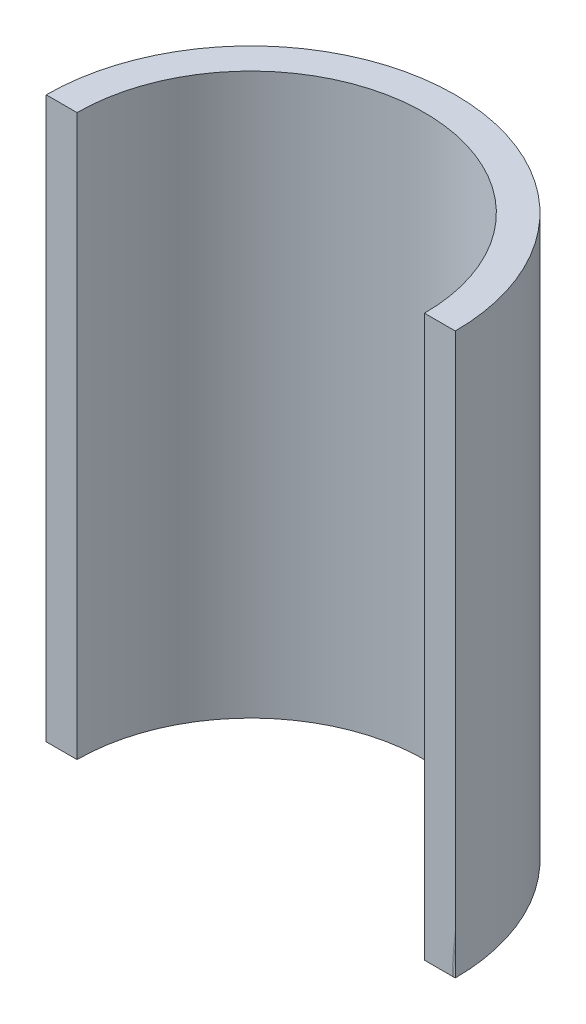
ISO-10303-21;
HEADER;
FILE_DESCRIPTION(('STEP AP214'),'2;1');
FILE_NAME('part.step','',(''),(''),'','','');
FILE_SCHEMA(('AUTOMOTIVE_DESIGN { 1 0 10303 214 1 1 1 1 }'));
ENDSEC;
DATA;
#1=APPLICATION_CONTEXT('core data for automotive mechanical design processes');
#2=APPLICATION_PROTOCOL_DEFINITION('international standard','automotive_design',2000,#1);
#3=PRODUCT_CONTEXT('',#1,'mechanical');
#4=PRODUCT('Part','Part','',(#3));
#5=PRODUCT_RELATED_PRODUCT_CATEGORY('part','',(#4));
#6=PRODUCT_DEFINITION_FORMATION('','',#4);
#7=PRODUCT_DEFINITION_CONTEXT('part definition',#1,'design');
#8=PRODUCT_DEFINITION('design','',#6,#7);
#9=PRODUCT_DEFINITION_SHAPE('','',#8);
#10=(LENGTH_UNIT() NAMED_UNIT(*) SI_UNIT(.MILLI.,.METRE.));
#11=(NAMED_UNIT(*) PLANE_ANGLE_UNIT() SI_UNIT($,.RADIAN.));
#12=(NAMED_UNIT(*) SI_UNIT($,.STERADIAN.) SOLID_ANGLE_UNIT());
#13=UNCERTAINTY_MEASURE_WITH_UNIT(LENGTH_MEASURE(1.E-05),#10,'distance_accuracy_value','');
#14=(GEOMETRIC_REPRESENTATION_CONTEXT(3) GLOBAL_UNCERTAINTY_ASSIGNED_CONTEXT((#13)) GLOBAL_UNIT_ASSIGNED_CONTEXT((#10,
#11,#12)) REPRESENTATION_CONTEXT('',''));
#15=CARTESIAN_POINT('',(0.,0.,0.));
#16=DIRECTION('',(0.,0.,1.));
#17=DIRECTION('',(1.,0.,0.));
#18=AXIS2_PLACEMENT_3D('',#15,#16,#17);
#19=CARTESIAN_POINT('',(36.5,100.,0.));
#20=DIRECTION('',(0.,0.,1.));
#21=DIRECTION('',(1.,0.,0.));
#22=AXIS2_PLACEMENT_3D('',#19,#20,#21);
#23=PLANE('',#22);
#24=DIRECTION('',(-1.,0.,0.));
#25=VECTOR('',#24,1.);
#26=CARTESIAN_POINT('',(36.5,0.,0.));
#27=LINE('',#26,#25);
#28=CARTESIAN_POINT('',(36.2,0.,0.));
#29=VERTEX_POINT('',#28);
#30=CARTESIAN_POINT('',(36.,0.,0.));
#31=VERTEX_POINT('',#30);
#32=EDGE_CURVE('E158',#29,#31,#27,.T.);
#33=ORIENTED_EDGE('',*,*,#32,.F.);
#34=CARTESIAN_POINT('',(86.,0.,0.));
#35=DIRECTION('',(0.,0.,1.));
#36=DIRECTION('',(1.,0.,0.));
#37=AXIS2_PLACEMENT_3D('',#34,#35,#36);
#38=CIRCLE('',#37,49.8);
#39=CARTESIAN_POINT('',(36.5,5.458021619598,0.));
#40=VERTEX_POINT('',#39);
#41=EDGE_CURVE('E11',#29,#40,#38,.F.);
#42=ORIENTED_EDGE('',*,*,#41,.T.);
#43=DIRECTION('',(0.,-1.,0.));
#44=VECTOR('',#43,1.);
#45=CARTESIAN_POINT('',(36.5,100.,0.));
#46=LINE('',#45,#44);
#47=CARTESIAN_POINT('',(36.5,7.05336798983309,0.));
#48=VERTEX_POINT('',#47);
#49=EDGE_CURVE('E110',#48,#40,#46,.T.);
#50=ORIENTED_EDGE('',*,*,#49,.F.);
#51=CARTESIAN_POINT('',(86.,0.,0.));
#52=DIRECTION('',(0.,0.,1.));
#53=DIRECTION('',(1.,0.,0.));
#54=AXIS2_PLACEMENT_3D('',#51,#52,#53);
#55=CIRCLE('',#54,50.);
#56=EDGE_CURVE('E56',#31,#48,#55,.F.);
#57=ORIENTED_EDGE('',*,*,#56,.F.);
#58=EDGE_LOOP('',(#33,#42,#50,#57));
#59=FACE_BOUND('',#58,.T.);
#60=ADVANCED_FACE('F47',(#59),#23,.T.);
#61=CARTESIAN_POINT('',(31.,0.,0.));
#62=VERTEX_POINT('',#61);
#63=EDGE_CURVE('E153',#31,#62,#27,.T.);
#64=ORIENTED_EDGE('',*,*,#63,.F.);
#65=ORIENTED_EDGE('',*,*,#56,.T.);
#66=CARTESIAN_POINT('',(36.5,100.,0.));
#67=VERTEX_POINT('',#66);
#68=EDGE_CURVE('E98',#67,#48,#46,.T.);
#69=ORIENTED_EDGE('',*,*,#68,.F.);
#70=DIRECTION('',(-1.,0.,0.));
#71=VECTOR('',#70,1.);
#72=CARTESIAN_POINT('',(36.5,100.,0.));
#73=LINE('',#72,#71);
#74=CARTESIAN_POINT('',(31.,100.,0.));
#75=VERTEX_POINT('',#74);
#76=EDGE_CURVE('E103',#67,#75,#73,.T.);
#77=ORIENTED_EDGE('',*,*,#76,.T.);
#78=DIRECTION('',(0.,-1.,0.));
#79=VECTOR('',#78,1.);
#80=CARTESIAN_POINT('',(31.,100.,0.));
#81=LINE('',#80,#79);
#82=EDGE_CURVE('E126',#62,#75,#81,.F.);
#83=ORIENTED_EDGE('',*,*,#82,.F.);
#84=EDGE_LOOP('',(#64,#65,#69,#77,#83));
#85=FACE_BOUND('',#84,.T.);
#86=ADVANCED_FACE('F101',(#85),#23,.T.);
#87=CARTESIAN_POINT('',(0.,100.,0.));
#88=DIRECTION('',(0.,-1.,0.));
#89=DIRECTION('',(0.,0.,-1.));
#90=AXIS2_PLACEMENT_3D('',#87,#88,#89);
#91=CYLINDRICAL_SURFACE('',#90,36.5);
#92=DIRECTION('',(0.,-1.,0.));
#93=VECTOR('',#92,1.);
#94=CARTESIAN_POINT('',(-36.5,100.,0.));
#95=LINE('',#94,#93);
#96=CARTESIAN_POINT('',(-36.5,100.,0.));
#97=VERTEX_POINT('',#96);
#98=CARTESIAN_POINT('',(-36.5,0.,0.));
#99=VERTEX_POINT('',#98);
#100=EDGE_CURVE('E121',#97,#99,#95,.T.);
#101=ORIENTED_EDGE('',*,*,#100,.F.);
#102=CARTESIAN_POINT('',(0.,100.,0.));
#103=DIRECTION('',(0.,1.,0.));
#104=DIRECTION('',(0.,0.,1.));
#105=AXIS2_PLACEMENT_3D('',#102,#103,#104);
#106=CIRCLE('',#105,36.5);
#107=EDGE_CURVE('E118',#67,#97,#106,.T.);
#108=ORIENTED_EDGE('',*,*,#107,.F.);
#109=ORIENTED_EDGE('',*,*,#68,.T.);
#110=ORIENTED_EDGE('',*,*,#49,.T.);
#111=CARTESIAN_POINT('',(36.5,0.,0.));
#112=VERTEX_POINT('',#111);
#113=EDGE_CURVE('E112',#40,#112,#46,.T.);
#114=ORIENTED_EDGE('',*,*,#113,.T.);
#115=CARTESIAN_POINT('',(0.,0.,0.));
#116=DIRECTION('',(0.,1.,0.));
#117=DIRECTION('',(0.,0.,1.));
#118=AXIS2_PLACEMENT_3D('',#115,#116,#117);
#119=CIRCLE('',#118,36.5);
#120=EDGE_CURVE('E127',#112,#99,#119,.T.);
#121=ORIENTED_EDGE('',*,*,#120,.T.);
#122=EDGE_LOOP('',(#101,#108,#109,#110,#114,#121));
#123=FACE_BOUND('',#122,.T.);
#124=ADVANCED_FACE('F49',(#123),#91,.T.);
#125=CARTESIAN_POINT('',(0.,100.,0.));
#126=DIRECTION('',(0.,1.,0.));
#127=DIRECTION('',(0.,0.,1.));
#128=AXIS2_PLACEMENT_3D('',#125,#126,#127);
#129=PLANE('',#128);
#130=ORIENTED_EDGE('',*,*,#107,.T.);
#131=CARTESIAN_POINT('',(-31.,100.,0.));
#132=VERTEX_POINT('',#131);
#133=EDGE_CURVE('E122',#132,#97,#73,.T.);
#134=ORIENTED_EDGE('',*,*,#133,.F.);
#135=CARTESIAN_POINT('',(0.,100.,0.));
#136=DIRECTION('',(0.,1.,0.));
#137=DIRECTION('',(0.,0.,1.));
#138=AXIS2_PLACEMENT_3D('',#135,#136,#137);
#139=CIRCLE('',#138,31.);
#140=EDGE_CURVE('E120',#75,#132,#139,.T.);
#141=ORIENTED_EDGE('',*,*,#140,.F.);
#142=ORIENTED_EDGE('',*,*,#76,.F.);
#143=EDGE_LOOP('',(#130,#134,#141,#142));
#144=FACE_BOUND('',#143,.T.);
#145=ADVANCED_FACE('F116',(#144),#129,.T.);
#146=CARTESIAN_POINT('',(0.,0.,0.));
#147=DIRECTION('',(0.,1.,0.));
#148=DIRECTION('',(0.,0.,1.));
#149=AXIS2_PLACEMENT_3D('',#146,#147,#148);
#150=PLANE('',#149);
#151=CARTESIAN_POINT('',(-31.,0.,0.));
#152=VERTEX_POINT('',#151);
#153=EDGE_CURVE('E152',#152,#99,#27,.T.);
#154=ORIENTED_EDGE('',*,*,#153,.T.);
#155=ORIENTED_EDGE('',*,*,#120,.F.);
#156=EDGE_CURVE('E156',#112,#29,#27,.T.);
#157=ORIENTED_EDGE('',*,*,#156,.T.);
#158=ORIENTED_EDGE('',*,*,#32,.T.);
#159=ORIENTED_EDGE('',*,*,#63,.T.);
#160=CARTESIAN_POINT('',(0.,0.,0.));
#161=DIRECTION('',(0.,1.,0.));
#162=DIRECTION('',(0.,0.,1.));
#163=AXIS2_PLACEMENT_3D('',#160,#161,#162);
#164=CIRCLE('',#163,31.);
#165=EDGE_CURVE('E109',#62,#152,#164,.T.);
#166=ORIENTED_EDGE('',*,*,#165,.T.);
#167=EDGE_LOOP('',(#154,#155,#157,#158,#159,#166));
#168=FACE_BOUND('',#167,.T.);
#169=ADVANCED_FACE('F150',(#168),#150,.F.);
#170=CARTESIAN_POINT('',(0.,100.,0.));
#171=DIRECTION('',(0.,-1.,0.));
#172=DIRECTION('',(0.,0.,-1.));
#173=AXIS2_PLACEMENT_3D('',#170,#171,#172);
#174=CYLINDRICAL_SURFACE('',#173,31.);
#175=ORIENTED_EDGE('',*,*,#140,.T.);
#176=DIRECTION('',(0.,-1.,0.));
#177=VECTOR('',#176,1.);
#178=CARTESIAN_POINT('',(-31.,100.,0.));
#179=LINE('',#178,#177);
#180=EDGE_CURVE('E129',#132,#152,#179,.T.);
#181=ORIENTED_EDGE('',*,*,#180,.T.);
#182=ORIENTED_EDGE('',*,*,#165,.F.);
#183=ORIENTED_EDGE('',*,*,#82,.T.);
#184=EDGE_LOOP('',(#175,#181,#182,#183));
#185=FACE_BOUND('',#184,.T.);
#186=ADVANCED_FACE('F146',(#185),#174,.F.);
#187=ORIENTED_EDGE('',*,*,#41,.F.);
#188=ORIENTED_EDGE('',*,*,#156,.F.);
#189=ORIENTED_EDGE('',*,*,#113,.F.);
#190=EDGE_LOOP('',(#187,#188,#189));
#191=FACE_BOUND('',#190,.T.);
#192=ADVANCED_FACE('F159',(#191),#23,.T.);
#193=ORIENTED_EDGE('',*,*,#133,.T.);
#194=ORIENTED_EDGE('',*,*,#100,.T.);
#195=ORIENTED_EDGE('',*,*,#153,.F.);
#196=ORIENTED_EDGE('',*,*,#180,.F.);
#197=EDGE_LOOP('',(#193,#194,#195,#196));
#198=FACE_BOUND('',#197,.T.);
#199=ADVANCED_FACE('F161',(#198),#23,.T.);
#200=CLOSED_SHELL('',(#60,#86,#124,#145,#169,#186,#192,#199));
#201=MANIFOLD_SOLID_BREP('B2',#200);
#202=ADVANCED_BREP_SHAPE_REPRESENTATION('',(#18,#201),#14);
#203=SHAPE_DEFINITION_REPRESENTATION(#9,#202);
ENDSEC;
END-ISO-10303-21;
